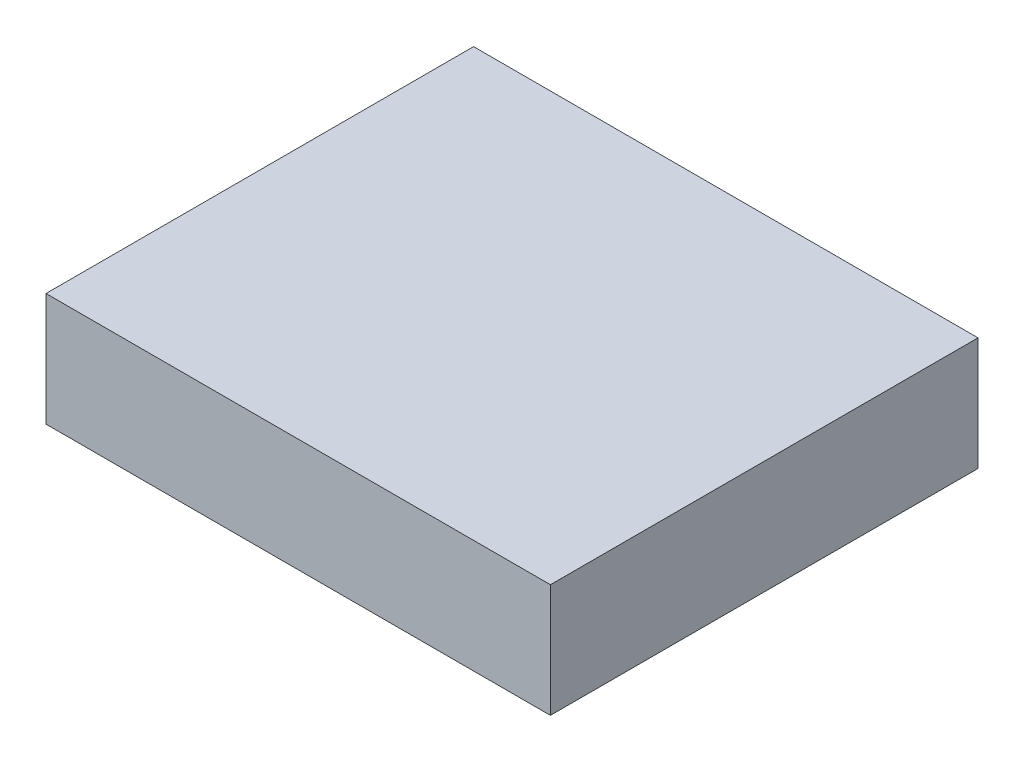
ISO-10303-21;
HEADER;
FILE_DESCRIPTION(('STEP AP214'),'2;1');
FILE_NAME('part.step','',(''),(''),'','','');
FILE_SCHEMA(('AUTOMOTIVE_DESIGN { 1 0 10303 214 1 1 1 1 }'));
ENDSEC;
DATA;
#1=APPLICATION_CONTEXT('core data for automotive mechanical design processes');
#2=APPLICATION_PROTOCOL_DEFINITION('international standard','automotive_design',2000,#1);
#3=PRODUCT_CONTEXT('',#1,'mechanical');
#4=PRODUCT('Part','Part','',(#3));
#5=PRODUCT_RELATED_PRODUCT_CATEGORY('part','',(#4));
#6=PRODUCT_DEFINITION_FORMATION('','',#4);
#7=PRODUCT_DEFINITION_CONTEXT('part definition',#1,'design');
#8=PRODUCT_DEFINITION('design','',#6,#7);
#9=PRODUCT_DEFINITION_SHAPE('','',#8);
#10=(LENGTH_UNIT() NAMED_UNIT(*) SI_UNIT(.MILLI.,.METRE.));
#11=(NAMED_UNIT(*) PLANE_ANGLE_UNIT() SI_UNIT($,.RADIAN.));
#12=(NAMED_UNIT(*) SI_UNIT($,.STERADIAN.) SOLID_ANGLE_UNIT());
#13=UNCERTAINTY_MEASURE_WITH_UNIT(LENGTH_MEASURE(1.E-05),#10,'distance_accuracy_value','');
#14=(GEOMETRIC_REPRESENTATION_CONTEXT(3) GLOBAL_UNCERTAINTY_ASSIGNED_CONTEXT((#13)) GLOBAL_UNIT_ASSIGNED_CONTEXT((#10,
#11,#12)) REPRESENTATION_CONTEXT('',''));
#15=CARTESIAN_POINT('',(0.,0.,0.));
#16=DIRECTION('',(0.,0.,1.));
#17=DIRECTION('',(1.,0.,0.));
#18=AXIS2_PLACEMENT_3D('',#15,#16,#17);
#19=CARTESIAN_POINT('',(390.,175.,330.606820825562));
#20=DIRECTION('',(-1.,0.,0.));
#21=DIRECTION('',(0.,0.,1.));
#22=AXIS2_PLACEMENT_3D('',#19,#20,#21);
#23=PLANE('',#22);
#24=DIRECTION('',(0.,0.,-1.));
#25=VECTOR('',#24,1.);
#26=CARTESIAN_POINT('',(390.,0.,330.606820825562));
#27=LINE('',#26,#25);
#28=CARTESIAN_POINT('',(390.,0.,330.606820825562));
#29=VERTEX_POINT('',#28);
#30=CARTESIAN_POINT('',(390.,0.,-330.606820825562));
#31=VERTEX_POINT('',#30);
#32=EDGE_CURVE('E100',#29,#31,#27,.T.);
#33=ORIENTED_EDGE('',*,*,#32,.T.);
#34=DIRECTION('',(0.,-1.,0.));
#35=VECTOR('',#34,1.);
#36=CARTESIAN_POINT('',(390.,175.,-330.606820825562));
#37=LINE('',#36,#35);
#38=CARTESIAN_POINT('',(390.,175.,-330.606820825562));
#39=VERTEX_POINT('',#38);
#40=EDGE_CURVE('E11',#39,#31,#37,.T.);
#41=ORIENTED_EDGE('',*,*,#40,.F.);
#42=DIRECTION('',(0.,0.,-1.));
#43=VECTOR('',#42,1.);
#44=CARTESIAN_POINT('',(390.,175.,330.606820825562));
#45=LINE('',#44,#43);
#46=CARTESIAN_POINT('',(390.,175.,330.606820825562));
#47=VERTEX_POINT('',#46);
#48=EDGE_CURVE('E88',#47,#39,#45,.T.);
#49=ORIENTED_EDGE('',*,*,#48,.F.);
#50=DIRECTION('',(0.,-1.,0.));
#51=VECTOR('',#50,1.);
#52=CARTESIAN_POINT('',(390.,175.,330.606820825562));
#53=LINE('',#52,#51);
#54=EDGE_CURVE('E96',#47,#29,#53,.T.);
#55=ORIENTED_EDGE('',*,*,#54,.T.);
#56=EDGE_LOOP('',(#33,#41,#49,#55));
#57=FACE_BOUND('',#56,.T.);
#58=ADVANCED_FACE('F37',(#57),#23,.F.);
#59=CARTESIAN_POINT('',(-390.,175.,-330.606820825562));
#60=DIRECTION('',(0.,0.,1.));
#61=DIRECTION('',(1.,0.,0.));
#62=AXIS2_PLACEMENT_3D('',#59,#60,#61);
#63=PLANE('',#62);
#64=DIRECTION('',(-1.,0.,0.));
#65=VECTOR('',#64,1.);
#66=CARTESIAN_POINT('',(-390.,0.,-330.606820825562));
#67=LINE('',#66,#65);
#68=CARTESIAN_POINT('',(-390.,0.,-330.606820825562));
#69=VERTEX_POINT('',#68);
#70=EDGE_CURVE('E92',#31,#69,#67,.T.);
#71=ORIENTED_EDGE('',*,*,#70,.T.);
#72=DIRECTION('',(0.,-1.,0.));
#73=VECTOR('',#72,1.);
#74=CARTESIAN_POINT('',(-390.,175.,-330.606820825562));
#75=LINE('',#74,#73);
#76=CARTESIAN_POINT('',(-390.,175.,-330.606820825562));
#77=VERTEX_POINT('',#76);
#78=EDGE_CURVE('E45',#77,#69,#75,.T.);
#79=ORIENTED_EDGE('',*,*,#78,.F.);
#80=DIRECTION('',(-1.,0.,0.));
#81=VECTOR('',#80,1.);
#82=CARTESIAN_POINT('',(-390.,175.,-330.606820825562));
#83=LINE('',#82,#81);
#84=EDGE_CURVE('E83',#39,#77,#83,.T.);
#85=ORIENTED_EDGE('',*,*,#84,.F.);
#86=ORIENTED_EDGE('',*,*,#40,.T.);
#87=EDGE_LOOP('',(#71,#79,#85,#86));
#88=FACE_BOUND('',#87,.T.);
#89=ADVANCED_FACE('F91',(#88),#63,.F.);
#90=CARTESIAN_POINT('',(-390.,175.,330.606820825562));
#91=DIRECTION('',(1.,0.,0.));
#92=DIRECTION('',(0.,0.,-1.));
#93=AXIS2_PLACEMENT_3D('',#90,#91,#92);
#94=PLANE('',#93);
#95=DIRECTION('',(0.,0.,1.));
#96=VECTOR('',#95,1.);
#97=CARTESIAN_POINT('',(-390.,0.,330.606820825562));
#98=LINE('',#97,#96);
#99=CARTESIAN_POINT('',(-390.,0.,330.606820825562));
#100=VERTEX_POINT('',#99);
#101=EDGE_CURVE('E70',#69,#100,#98,.T.);
#102=ORIENTED_EDGE('',*,*,#101,.T.);
#103=DIRECTION('',(0.,-1.,0.));
#104=VECTOR('',#103,1.);
#105=CARTESIAN_POINT('',(-390.,175.,330.606820825562));
#106=LINE('',#105,#104);
#107=CARTESIAN_POINT('',(-390.,175.,330.606820825562));
#108=VERTEX_POINT('',#107);
#109=EDGE_CURVE('E93',#108,#100,#106,.T.);
#110=ORIENTED_EDGE('',*,*,#109,.F.);
#111=DIRECTION('',(0.,0.,1.));
#112=VECTOR('',#111,1.);
#113=CARTESIAN_POINT('',(-390.,175.,330.606820825562));
#114=LINE('',#113,#112);
#115=EDGE_CURVE('E86',#77,#108,#114,.T.);
#116=ORIENTED_EDGE('',*,*,#115,.F.);
#117=ORIENTED_EDGE('',*,*,#78,.T.);
#118=EDGE_LOOP('',(#102,#110,#116,#117));
#119=FACE_BOUND('',#118,.T.);
#120=ADVANCED_FACE('F94',(#119),#94,.F.);
#121=CARTESIAN_POINT('',(-390.,175.,330.606820825562));
#122=DIRECTION('',(0.,0.,-1.));
#123=DIRECTION('',(-1.,0.,0.));
#124=AXIS2_PLACEMENT_3D('',#121,#122,#123);
#125=PLANE('',#124);
#126=DIRECTION('',(1.,0.,0.));
#127=VECTOR('',#126,1.);
#128=CARTESIAN_POINT('',(-390.,0.,330.606820825562));
#129=LINE('',#128,#127);
#130=EDGE_CURVE('E76',#100,#29,#129,.T.);
#131=ORIENTED_EDGE('',*,*,#130,.T.);
#132=ORIENTED_EDGE('',*,*,#54,.F.);
#133=DIRECTION('',(1.,0.,0.));
#134=VECTOR('',#133,1.);
#135=CARTESIAN_POINT('',(-390.,175.,330.606820825562));
#136=LINE('',#135,#134);
#137=EDGE_CURVE('E53',#108,#47,#136,.T.);
#138=ORIENTED_EDGE('',*,*,#137,.F.);
#139=ORIENTED_EDGE('',*,*,#109,.T.);
#140=EDGE_LOOP('',(#131,#132,#138,#139));
#141=FACE_BOUND('',#140,.T.);
#142=ADVANCED_FACE('F107',(#141),#125,.F.);
#143=CARTESIAN_POINT('',(0.,175.,0.));
#144=DIRECTION('',(0.,-1.,0.));
#145=DIRECTION('',(0.,0.,-1.));
#146=AXIS2_PLACEMENT_3D('',#143,#144,#145);
#147=PLANE('',#146);
#148=ORIENTED_EDGE('',*,*,#48,.T.);
#149=ORIENTED_EDGE('',*,*,#84,.T.);
#150=ORIENTED_EDGE('',*,*,#115,.T.);
#151=ORIENTED_EDGE('',*,*,#137,.T.);
#152=EDGE_LOOP('',(#148,#149,#150,#151));
#153=FACE_BOUND('',#152,.T.);
#154=ADVANCED_FACE('F84',(#153),#147,.F.);
#155=CARTESIAN_POINT('',(0.,0.,0.));
#156=DIRECTION('',(0.,-1.,0.));
#157=DIRECTION('',(0.,0.,-1.));
#158=AXIS2_PLACEMENT_3D('',#155,#156,#157);
#159=PLANE('',#158);
#160=ORIENTED_EDGE('',*,*,#32,.F.);
#161=ORIENTED_EDGE('',*,*,#130,.F.);
#162=ORIENTED_EDGE('',*,*,#101,.F.);
#163=ORIENTED_EDGE('',*,*,#70,.F.);
#164=EDGE_LOOP('',(#160,#161,#162,#163));
#165=FACE_BOUND('',#164,.T.);
#166=ADVANCED_FACE('F110',(#165),#159,.T.);
#167=CLOSED_SHELL('',(#58,#89,#120,#142,#154,#166));
#168=MANIFOLD_SOLID_BREP('B2',#167);
#169=ADVANCED_BREP_SHAPE_REPRESENTATION('',(#18,#168),#14);
#170=SHAPE_DEFINITION_REPRESENTATION(#9,#169);
ENDSEC;
END-ISO-10303-21;
